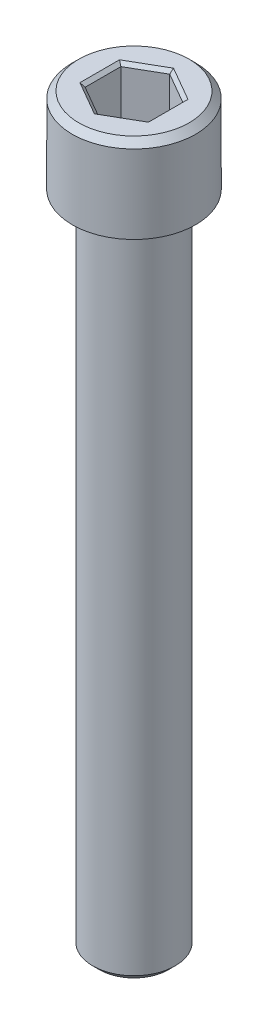
ISO-10303-21;
HEADER;
FILE_DESCRIPTION(('STEP AP214'),'2;1');
FILE_NAME('part.step','',(''),(''),'','','');
FILE_SCHEMA(('AUTOMOTIVE_DESIGN { 1 0 10303 214 1 1 1 1 }'));
ENDSEC;
DATA;
#1=APPLICATION_CONTEXT('core data for automotive mechanical design processes');
#2=APPLICATION_PROTOCOL_DEFINITION('international standard','automotive_design',2000,#1);
#3=PRODUCT_CONTEXT('',#1,'mechanical');
#4=PRODUCT('Part','Part','',(#3));
#5=PRODUCT_RELATED_PRODUCT_CATEGORY('part','',(#4));
#6=PRODUCT_DEFINITION_FORMATION('','',#4);
#7=PRODUCT_DEFINITION_CONTEXT('part definition',#1,'design');
#8=PRODUCT_DEFINITION('design','',#6,#7);
#9=PRODUCT_DEFINITION_SHAPE('','',#8);
#10=(LENGTH_UNIT() NAMED_UNIT(*) SI_UNIT(.MILLI.,.METRE.));
#11=(NAMED_UNIT(*) PLANE_ANGLE_UNIT() SI_UNIT($,.RADIAN.));
#12=(NAMED_UNIT(*) SI_UNIT($,.STERADIAN.) SOLID_ANGLE_UNIT());
#13=UNCERTAINTY_MEASURE_WITH_UNIT(LENGTH_MEASURE(1.E-05),#10,'distance_accuracy_value','');
#14=(GEOMETRIC_REPRESENTATION_CONTEXT(3) GLOBAL_UNCERTAINTY_ASSIGNED_CONTEXT((#13)) GLOBAL_UNIT_ASSIGNED_CONTEXT((#10,
#11,#12)) REPRESENTATION_CONTEXT('',''));
#15=CARTESIAN_POINT('',(0.,0.,0.));
#16=DIRECTION('',(0.,0.,1.));
#17=DIRECTION('',(1.,0.,0.));
#18=AXIS2_PLACEMENT_3D('',#15,#16,#17);
#19=CARTESIAN_POINT('',(-4.77519999999997,-4.57200000000002,0.));
#20=DIRECTION('',(0.,-1.,0.));
#21=DIRECTION('',(0.,0.,-1.));
#22=AXIS2_PLACEMENT_3D('',#19,#20,#21);
#23=PLANE('',#22);
#24=DIRECTION('',(-0.866025403784438,0.,0.5));
#25=VECTOR('',#24,1.);
#26=CARTESIAN_POINT('',(2.3876,-4.57200000000002,1.37848150271715));
#27=LINE('',#26,#25);
#28=CARTESIAN_POINT('',(2.3876,-4.57200000000002,1.37848150271715));
#29=VERTEX_POINT('',#28);
#30=CARTESIAN_POINT('',(0.,-4.57200000000002,2.7569630054343));
#31=VERTEX_POINT('',#30);
#32=EDGE_CURVE('E86',#29,#31,#27,.T.);
#33=ORIENTED_EDGE('',*,*,#32,.F.);
#34=DIRECTION('',(0.,0.,1.));
#35=VECTOR('',#34,1.);
#36=CARTESIAN_POINT('',(2.3876,-4.57200000000002,-1.37848150271715));
#37=LINE('',#36,#35);
#38=CARTESIAN_POINT('',(2.3876,-4.57200000000002,-1.37848150271715));
#39=VERTEX_POINT('',#38);
#40=EDGE_CURVE('E91',#39,#29,#37,.T.);
#41=ORIENTED_EDGE('',*,*,#40,.F.);
#42=DIRECTION('',(0.866025403784438,0.,0.5));
#43=VECTOR('',#42,1.);
#44=CARTESIAN_POINT('',(0.,-4.57200000000002,-2.75696300543429));
#45=LINE('',#44,#43);
#46=CARTESIAN_POINT('',(0.,-4.57200000000002,-2.75696300543429));
#47=VERTEX_POINT('',#46);
#48=EDGE_CURVE('E172',#47,#39,#45,.T.);
#49=ORIENTED_EDGE('',*,*,#48,.F.);
#50=DIRECTION('',(0.866025403784438,0.,-0.5));
#51=VECTOR('',#50,1.);
#52=CARTESIAN_POINT('',(-2.38759999999999,-4.57200000000002,-1.37848150271714));
#53=LINE('',#52,#51);
#54=CARTESIAN_POINT('',(-2.38759999999997,-4.57200000000002,-1.37848150271714));
#55=VERTEX_POINT('',#54);
#56=EDGE_CURVE('E178',#55,#47,#53,.T.);
#57=ORIENTED_EDGE('',*,*,#56,.F.);
#58=DIRECTION('',(0.,0.,-1.));
#59=VECTOR('',#58,1.);
#60=CARTESIAN_POINT('',(-2.38759999999996,-4.57200000000002,1.37848150271717));
#61=LINE('',#60,#59);
#62=CARTESIAN_POINT('',(-2.38759999999996,-4.57200000000002,1.37848150271717));
#63=VERTEX_POINT('',#62);
#64=EDGE_CURVE('E183',#63,#55,#61,.T.);
#65=ORIENTED_EDGE('',*,*,#64,.F.);
#66=DIRECTION('',(-0.866025403784438,0.,-0.500000000000001));
#67=VECTOR('',#66,1.);
#68=CARTESIAN_POINT('',(0.,-4.57200000000002,2.75696300543431));
#69=LINE('',#68,#67);
#70=EDGE_CURVE('E102',#31,#63,#69,.T.);
#71=ORIENTED_EDGE('',*,*,#70,.F.);
#72=EDGE_LOOP('',(#33,#41,#49,#57,#65,#71));
#73=FACE_BOUND('',#72,.T.);
#74=ADVANCED_FACE('F17',(#73),#23,.F.);
#75=CARTESIAN_POINT('',(2.3876,-4.57200000000002,-1.37848150271715));
#76=DIRECTION('',(-1.,0.,0.));
#77=DIRECTION('',(0.,0.,1.));
#78=AXIS2_PLACEMENT_3D('',#75,#76,#77);
#79=PLANE('',#78);
#80=DIRECTION('',(0.,1.,0.));
#81=VECTOR('',#80,1.);
#82=CARTESIAN_POINT('',(2.3876,-4.57200000000002,-1.37848150271715));
#83=LINE('',#82,#81);
#84=CARTESIAN_POINT('',(2.38760000000001,-0.253999999999981,-1.37848150271715));
#85=VERTEX_POINT('',#84);
#86=EDGE_CURVE('E96',#39,#85,#83,.T.);
#87=ORIENTED_EDGE('',*,*,#86,.F.);
#88=ORIENTED_EDGE('',*,*,#40,.T.);
#89=DIRECTION('',(0.,1.,0.));
#90=VECTOR('',#89,1.);
#91=CARTESIAN_POINT('',(2.3876,-4.57200000000002,1.37848150271715));
#92=LINE('',#91,#90);
#93=CARTESIAN_POINT('',(2.38760000000001,-0.25399999999998,1.37848150271715));
#94=VERTEX_POINT('',#93);
#95=EDGE_CURVE('E93',#94,#29,#92,.F.);
#96=ORIENTED_EDGE('',*,*,#95,.F.);
#97=DIRECTION('',(0.,0.,1.));
#98=VECTOR('',#97,1.);
#99=CARTESIAN_POINT('',(2.38760000000002,-0.25399999999999,0.));
#100=LINE('',#99,#98);
#101=EDGE_CURVE('E170',#94,#85,#100,.F.);
#102=ORIENTED_EDGE('',*,*,#101,.T.);
#103=EDGE_LOOP('',(#87,#88,#96,#102));
#104=FACE_BOUND('',#103,.T.);
#105=ADVANCED_FACE('F92',(#104),#79,.T.);
#106=CARTESIAN_POINT('',(2.3876,-4.57200000000002,1.37848150271715));
#107=DIRECTION('',(-0.5,0.,-0.866025403784438));
#108=DIRECTION('',(-0.866025403784438,0.,0.5));
#109=AXIS2_PLACEMENT_3D('',#106,#107,#108);
#110=PLANE('',#109);
#111=ORIENTED_EDGE('',*,*,#95,.T.);
#112=ORIENTED_EDGE('',*,*,#32,.T.);
#113=DIRECTION('',(0.,1.,0.));
#114=VECTOR('',#113,1.);
#115=CARTESIAN_POINT('',(0.,-4.57200000000002,2.75696300543431));
#116=LINE('',#115,#114);
#117=CARTESIAN_POINT('',(0.,-0.253999999999979,2.75696300543431));
#118=VERTEX_POINT('',#117);
#119=EDGE_CURVE('E104',#118,#31,#116,.F.);
#120=ORIENTED_EDGE('',*,*,#119,.F.);
#121=DIRECTION('',(0.866025403784438,0.,-0.500000000000001));
#122=VECTOR('',#121,1.);
#123=CARTESIAN_POINT('',(0.,-0.253999999999987,2.75696300543432));
#124=LINE('',#123,#122);
#125=EDGE_CURVE('E108',#118,#94,#124,.T.);
#126=ORIENTED_EDGE('',*,*,#125,.T.);
#127=EDGE_LOOP('',(#111,#112,#120,#126));
#128=FACE_BOUND('',#127,.T.);
#129=ADVANCED_FACE('F106',(#128),#110,.T.);
#130=CARTESIAN_POINT('',(0.,-4.57200000000002,2.75696300543431));
#131=DIRECTION('',(0.500000000000001,0.,-0.866025403784438));
#132=DIRECTION('',(-0.866025403784438,0.,-0.500000000000001));
#133=AXIS2_PLACEMENT_3D('',#130,#131,#132);
#134=PLANE('',#133);
#135=ORIENTED_EDGE('',*,*,#119,.T.);
#136=ORIENTED_EDGE('',*,*,#70,.T.);
#137=DIRECTION('',(0.,1.,0.));
#138=VECTOR('',#137,1.);
#139=CARTESIAN_POINT('',(-2.38759999999996,-4.57200000000002,1.37848150271717));
#140=LINE('',#139,#138);
#141=CARTESIAN_POINT('',(-2.38759999999997,-0.253999999999979,1.37848150271717));
#142=VERTEX_POINT('',#141);
#143=EDGE_CURVE('E185',#142,#63,#140,.F.);
#144=ORIENTED_EDGE('',*,*,#143,.F.);
#145=DIRECTION('',(0.866025403784438,0.,0.500000000000002));
#146=VECTOR('',#145,1.);
#147=CARTESIAN_POINT('',(-2.38759999999997,-0.253999999999992,1.37848150271718));
#148=LINE('',#147,#146);
#149=EDGE_CURVE('E164',#142,#118,#148,.T.);
#150=ORIENTED_EDGE('',*,*,#149,.T.);
#151=EDGE_LOOP('',(#135,#136,#144,#150));
#152=FACE_BOUND('',#151,.T.);
#153=ADVANCED_FACE('F189',(#152),#134,.T.);
#154=CARTESIAN_POINT('',(-2.38759999999996,-4.57200000000002,1.37848150271717));
#155=DIRECTION('',(1.,0.,0.));
#156=DIRECTION('',(0.,0.,-1.));
#157=AXIS2_PLACEMENT_3D('',#154,#155,#156);
#158=PLANE('',#157);
#159=ORIENTED_EDGE('',*,*,#143,.T.);
#160=ORIENTED_EDGE('',*,*,#64,.T.);
#161=DIRECTION('',(0.,1.,0.));
#162=VECTOR('',#161,1.);
#163=CARTESIAN_POINT('',(-2.38759999999999,-4.57200000000002,-1.37848150271714));
#164=LINE('',#163,#162);
#165=CARTESIAN_POINT('',(-2.38759999999998,-0.253999999999979,-1.37848150271714));
#166=VERTEX_POINT('',#165);
#167=EDGE_CURVE('E180',#166,#55,#164,.F.);
#168=ORIENTED_EDGE('',*,*,#167,.F.);
#169=DIRECTION('',(0.,0.,1.));
#170=VECTOR('',#169,1.);
#171=CARTESIAN_POINT('',(-2.3876,-0.253999999999983,0.));
#172=LINE('',#171,#170);
#173=EDGE_CURVE('E159',#166,#142,#172,.T.);
#174=ORIENTED_EDGE('',*,*,#173,.T.);
#175=EDGE_LOOP('',(#159,#160,#168,#174));
#176=FACE_BOUND('',#175,.T.);
#177=ADVANCED_FACE('F219',(#176),#158,.T.);
#178=CARTESIAN_POINT('',(-2.38759999999999,-4.57200000000002,-1.37848150271714));
#179=DIRECTION('',(0.5,0.,0.866025403784438));
#180=DIRECTION('',(0.866025403784438,0.,-0.5));
#181=AXIS2_PLACEMENT_3D('',#178,#179,#180);
#182=PLANE('',#181);
#183=ORIENTED_EDGE('',*,*,#167,.T.);
#184=ORIENTED_EDGE('',*,*,#56,.T.);
#185=DIRECTION('',(0.,1.,0.));
#186=VECTOR('',#185,1.);
#187=CARTESIAN_POINT('',(0.,-4.57200000000002,-2.75696300543429));
#188=LINE('',#187,#186);
#189=CARTESIAN_POINT('',(0.,-0.253999999999979,-2.7569630054343));
#190=VERTEX_POINT('',#189);
#191=EDGE_CURVE('E174',#190,#47,#188,.F.);
#192=ORIENTED_EDGE('',*,*,#191,.F.);
#193=DIRECTION('',(-0.866025403784438,0.,0.5));
#194=VECTOR('',#193,1.);
#195=CARTESIAN_POINT('',(0.,-0.253999999999991,-2.75696300543431));
#196=LINE('',#195,#194);
#197=EDGE_CURVE('E154',#190,#166,#196,.T.);
#198=ORIENTED_EDGE('',*,*,#197,.T.);
#199=EDGE_LOOP('',(#183,#184,#192,#198));
#200=FACE_BOUND('',#199,.T.);
#201=ADVANCED_FACE('F215',(#200),#182,.T.);
#202=CARTESIAN_POINT('',(0.,-4.57200000000002,-2.75696300543429));
#203=DIRECTION('',(-0.5,0.,0.866025403784438));
#204=DIRECTION('',(0.866025403784438,0.,0.5));
#205=AXIS2_PLACEMENT_3D('',#202,#203,#204);
#206=PLANE('',#205);
#207=ORIENTED_EDGE('',*,*,#191,.T.);
#208=ORIENTED_EDGE('',*,*,#48,.T.);
#209=ORIENTED_EDGE('',*,*,#86,.T.);
#210=DIRECTION('',(-0.866025403784438,0.,-0.5));
#211=VECTOR('',#210,1.);
#212=CARTESIAN_POINT('',(2.38760000000001,-0.253999999999982,-1.37848150271715));
#213=LINE('',#212,#211);
#214=EDGE_CURVE('E146',#85,#190,#213,.T.);
#215=ORIENTED_EDGE('',*,*,#214,.T.);
#216=EDGE_LOOP('',(#207,#208,#209,#215));
#217=FACE_BOUND('',#216,.T.);
#218=ADVANCED_FACE('F210',(#217),#206,.T.);
#219=CARTESIAN_POINT('',(2.64160000000001,0.,0.));
#220=DIRECTION('',(0.707106781186548,-0.707106781186547,0.));
#221=DIRECTION('',(0.707106781186547,0.707106781186548,0.));
#222=AXIS2_PLACEMENT_3D('',#219,#220,#221);
#223=PLANE('',#222);
#224=ORIENTED_EDGE('',*,*,#101,.F.);
#225=DIRECTION('',(0.654653670707951,0.654653670707987,0.377964473009256));
#226=VECTOR('',#225,1.);
#227=CARTESIAN_POINT('',(2.38760000000001,-0.253999999999991,1.37848150271716));
#228=LINE('',#227,#226);
#229=CARTESIAN_POINT('',(2.64160000000001,0.,1.52512847109134));
#230=VERTEX_POINT('',#229);
#231=EDGE_CURVE('E167',#94,#230,#228,.T.);
#232=ORIENTED_EDGE('',*,*,#231,.T.);
#233=DIRECTION('',(0.,0.,1.));
#234=VECTOR('',#233,1.);
#235=CARTESIAN_POINT('',(2.64160000000001,0.,0.));
#236=LINE('',#235,#234);
#237=CARTESIAN_POINT('',(2.64160000000001,0.,-1.52512847109129));
#238=VERTEX_POINT('',#237);
#239=EDGE_CURVE('E142',#238,#230,#236,.T.);
#240=ORIENTED_EDGE('',*,*,#239,.F.);
#241=DIRECTION('',(-0.654653670708017,-0.654653670707961,0.377964473009186));
#242=VECTOR('',#241,1.);
#243=CARTESIAN_POINT('',(2.64160000000001,0.,-1.52512847109129));
#244=LINE('',#243,#242);
#245=EDGE_CURVE('E149',#238,#85,#244,.T.);
#246=ORIENTED_EDGE('',*,*,#245,.T.);
#247=EDGE_LOOP('',(#224,#232,#240,#246));
#248=FACE_BOUND('',#247,.T.);
#249=ADVANCED_FACE('F205',(#248),#223,.F.);
#250=CARTESIAN_POINT('',(1.3208,0.,2.28769270663698));
#251=DIRECTION('',(0.353553390593274,-0.707106781186548,0.612372435695794));
#252=DIRECTION('',(0.,-0.654653670707976,-0.755928946018455));
#253=AXIS2_PLACEMENT_3D('',#250,#251,#252);
#254=PLANE('',#253);
#255=ORIENTED_EDGE('',*,*,#125,.F.);
#256=DIRECTION('',(0.,-0.654653670707977,-0.755928946018455));
#257=VECTOR('',#256,1.);
#258=CARTESIAN_POINT('',(0.,-0.377371428571426,2.61450595044226));
#259=LINE('',#258,#257);
#260=CARTESIAN_POINT('',(0.,0.,3.05025694218264));
#261=VERTEX_POINT('',#260);
#262=EDGE_CURVE('E162',#118,#261,#259,.F.);
#263=ORIENTED_EDGE('',*,*,#262,.T.);
#264=DIRECTION('',(-0.866025403784443,0.,0.499999999999993));
#265=VECTOR('',#264,1.);
#266=CARTESIAN_POINT('',(2.64160000000001,0.,1.52512847109135));
#267=LINE('',#266,#265);
#268=EDGE_CURVE('E139',#230,#261,#267,.T.);
#269=ORIENTED_EDGE('',*,*,#268,.F.);
#270=ORIENTED_EDGE('',*,*,#231,.F.);
#271=EDGE_LOOP('',(#255,#263,#269,#270));
#272=FACE_BOUND('',#271,.T.);
#273=ADVANCED_FACE('F196',(#272),#254,.F.);
#274=CARTESIAN_POINT('',(-1.3208,0.,2.28769270663698));
#275=DIRECTION('',(-0.353553390593274,-0.707106781186548,0.612372435695794));
#276=DIRECTION('',(0.,-0.654653670707977,-0.755928946018455));
#277=AXIS2_PLACEMENT_3D('',#274,#275,#276);
#278=PLANE('',#277);
#279=DIRECTION('',(-0.866025403784436,0.,-0.500000000000004));
#280=VECTOR('',#279,1.);
#281=CARTESIAN_POINT('',(0.,0.,3.05025694218264));
#282=LINE('',#281,#280);
#283=CARTESIAN_POINT('',(-2.64159999999998,0.,1.52512847109132));
#284=VERTEX_POINT('',#283);
#285=EDGE_CURVE('E136',#261,#284,#282,.T.);
#286=ORIENTED_EDGE('',*,*,#285,.F.);
#287=ORIENTED_EDGE('',*,*,#262,.F.);
#288=ORIENTED_EDGE('',*,*,#149,.F.);
#289=DIRECTION('',(-0.654653670707984,0.654653670707984,0.377964473009202));
#290=VECTOR('',#289,1.);
#291=CARTESIAN_POINT('',(-2.38759999999998,-0.253999999999997,1.37848150271717));
#292=LINE('',#291,#290);
#293=EDGE_CURVE('E157',#142,#284,#292,.T.);
#294=ORIENTED_EDGE('',*,*,#293,.T.);
#295=EDGE_LOOP('',(#286,#287,#288,#294));
#296=FACE_BOUND('',#295,.T.);
#297=ADVANCED_FACE('F199',(#296),#278,.F.);
#298=CARTESIAN_POINT('',(-2.64159999999998,0.,0.));
#299=DIRECTION('',(-0.707106781186548,-0.707106781186547,0.));
#300=DIRECTION('',(0.707106781186547,-0.707106781186548,0.));
#301=AXIS2_PLACEMENT_3D('',#298,#299,#300);
#302=PLANE('',#301);
#303=DIRECTION('',(0.,0.,1.));
#304=VECTOR('',#303,1.);
#305=CARTESIAN_POINT('',(-2.64159999999998,0.,0.));
#306=LINE('',#305,#304);
#307=CARTESIAN_POINT('',(-2.64159999999998,0.,-1.52512847109131));
#308=VERTEX_POINT('',#307);
#309=EDGE_CURVE('E133',#284,#308,#306,.F.);
#310=ORIENTED_EDGE('',*,*,#309,.F.);
#311=ORIENTED_EDGE('',*,*,#293,.F.);
#312=ORIENTED_EDGE('',*,*,#173,.F.);
#313=DIRECTION('',(-0.654653670707983,0.654653670707975,-0.377964473009221));
#314=VECTOR('',#313,1.);
#315=CARTESIAN_POINT('',(-2.3876,-0.253999999999991,-1.37848150271715));
#316=LINE('',#315,#314);
#317=EDGE_CURVE('E152',#166,#308,#316,.T.);
#318=ORIENTED_EDGE('',*,*,#317,.T.);
#319=EDGE_LOOP('',(#310,#311,#312,#318));
#320=FACE_BOUND('',#319,.T.);
#321=ADVANCED_FACE('F217',(#320),#302,.F.);
#322=CARTESIAN_POINT('',(-1.3208,0.,-2.28769270663697));
#323=DIRECTION('',(-0.353553390593274,-0.707106781186547,-0.612372435695795));
#324=DIRECTION('',(0.,0.654653670707977,-0.755928946018454));
#325=AXIS2_PLACEMENT_3D('',#322,#323,#324);
#326=PLANE('',#325);
#327=ORIENTED_EDGE('',*,*,#197,.F.);
#328=DIRECTION('',(0.,0.654653670707977,-0.755928946018455));
#329=VECTOR('',#328,1.);
#330=CARTESIAN_POINT('',(0.,-0.377371428571423,-2.61450595044224));
#331=LINE('',#330,#329);
#332=CARTESIAN_POINT('',(0.,0.,-3.05025694218262));
#333=VERTEX_POINT('',#332);
#334=EDGE_CURVE('E35',#190,#333,#331,.T.);
#335=ORIENTED_EDGE('',*,*,#334,.T.);
#336=DIRECTION('',(0.86602540378444,0.,-0.499999999999998));
#337=VECTOR('',#336,1.);
#338=CARTESIAN_POINT('',(-2.64159999999999,0.,-1.52512847109131));
#339=LINE('',#338,#337);
#340=EDGE_CURVE('E130',#308,#333,#339,.T.);
#341=ORIENTED_EDGE('',*,*,#340,.F.);
#342=ORIENTED_EDGE('',*,*,#317,.F.);
#343=EDGE_LOOP('',(#327,#335,#341,#342));
#344=FACE_BOUND('',#343,.T.);
#345=ADVANCED_FACE('F212',(#344),#326,.F.);
#346=CARTESIAN_POINT('',(1.3208,0.,-2.28769270663696));
#347=DIRECTION('',(0.353553390593274,-0.707106781186548,-0.612372435695794));
#348=DIRECTION('',(0.,0.654653670707977,-0.755928946018455));
#349=AXIS2_PLACEMENT_3D('',#346,#347,#348);
#350=PLANE('',#349);
#351=ORIENTED_EDGE('',*,*,#214,.F.);
#352=ORIENTED_EDGE('',*,*,#245,.F.);
#353=DIRECTION('',(0.866025403784436,0.,0.500000000000005));
#354=VECTOR('',#353,1.);
#355=CARTESIAN_POINT('',(0.,0.,-3.05025694218262));
#356=LINE('',#355,#354);
#357=EDGE_CURVE('E125',#333,#238,#356,.T.);
#358=ORIENTED_EDGE('',*,*,#357,.F.);
#359=ORIENTED_EDGE('',*,*,#334,.F.);
#360=EDGE_LOOP('',(#351,#352,#358,#359));
#361=FACE_BOUND('',#360,.T.);
#362=ADVANCED_FACE('F208',(#361),#350,.F.);
#363=CARTESIAN_POINT('',(0.,0.,0.));
#364=DIRECTION('',(0.,1.,0.));
#365=DIRECTION('',(0.,0.,1.));
#366=AXIS2_PLACEMENT_3D('',#363,#364,#365);
#367=PLANE('',#366);
#368=CARTESIAN_POINT('',(0.,0.,0.));
#369=DIRECTION('',(0.,-1.,0.));
#370=DIRECTION('',(0.,0.,-1.));
#371=AXIS2_PLACEMENT_3D('',#368,#369,#370);
#372=CIRCLE('',#371,4.25450000005867);
#373=CARTESIAN_POINT('',(0.,0.,-4.25450000005867));
#374=VERTEX_POINT('',#373);
#375=EDGE_CURVE('E20',#374,#374,#372,.T.);
#376=ORIENTED_EDGE('',*,*,#375,.F.);
#377=EDGE_LOOP('',(#376));
#378=FACE_BOUND('',#377,.T.);
#379=ORIENTED_EDGE('',*,*,#340,.T.);
#380=ORIENTED_EDGE('',*,*,#357,.T.);
#381=ORIENTED_EDGE('',*,*,#239,.T.);
#382=ORIENTED_EDGE('',*,*,#268,.T.);
#383=ORIENTED_EDGE('',*,*,#285,.T.);
#384=ORIENTED_EDGE('',*,*,#309,.T.);
#385=EDGE_LOOP('',(#379,#380,#381,#382,#383,#384));
#386=FACE_BOUND('',#385,.T.);
#387=ADVANCED_FACE('F202',(#378,#386),#367,.T.);
#388=CARTESIAN_POINT('',(0.,-0.507999999911135,0.));
#389=DIRECTION('',(0.,-1.,0.));
#390=DIRECTION('',(0.,0.,-1.));
#391=AXIS2_PLACEMENT_3D('',#388,#389,#390);
#392=CONICAL_SURFACE('',#391,4.76250000002665,0.785398163453397);
#393=CARTESIAN_POINT('',(0.,-0.507999999999953,0.));
#394=DIRECTION('',(0.,1.,0.));
#395=DIRECTION('',(0.,0.,1.));
#396=AXIS2_PLACEMENT_3D('',#393,#394,#395);
#397=CIRCLE('',#396,4.7625);
#398=CARTESIAN_POINT('',(0.,-0.507999999999953,4.7625));
#399=VERTEX_POINT('',#398);
#400=EDGE_CURVE('E117',#399,#399,#397,.F.);
#401=ORIENTED_EDGE('',*,*,#400,.F.);
#402=EDGE_LOOP('',(#401));
#403=FACE_BOUND('',#402,.T.);
#404=ORIENTED_EDGE('',*,*,#375,.T.);
#405=EDGE_LOOP('',(#404));
#406=FACE_BOUND('',#405,.T.);
#407=ADVANCED_FACE('F252',(#403,#406),#392,.T.);
#408=CARTESIAN_POINT('',(0.,-57.3531999999999,0.));
#409=DIRECTION('',(0.,1.,0.));
#410=DIRECTION('',(0.,0.,1.));
#411=AXIS2_PLACEMENT_3D('',#408,#409,#410);
#412=PLANE('',#411);
#413=CARTESIAN_POINT('',(0.,-57.3532000000228,0.));
#414=DIRECTION('',(0.,1.,0.));
#415=DIRECTION('',(-1.,0.,0.));
#416=AXIS2_PLACEMENT_3D('',#413,#414,#415);
#417=CIRCLE('',#416,2.66699999991715);
#418=CARTESIAN_POINT('',(-2.66699999991715,-57.3532000000228,0.));
#419=VERTEX_POINT('',#418);
#420=EDGE_CURVE('E115',#419,#419,#417,.T.);
#421=ORIENTED_EDGE('',*,*,#420,.F.);
#422=EDGE_LOOP('',(#421));
#423=FACE_BOUND('',#422,.T.);
#424=ADVANCED_FACE('F249',(#423),#412,.F.);
#425=CARTESIAN_POINT('',(0.,-6.55319999999992,0.));
#426=DIRECTION('',(0.,1.,0.));
#427=DIRECTION('',(0.,0.,1.));
#428=AXIS2_PLACEMENT_3D('',#425,#426,#427);
#429=CYLINDRICAL_SURFACE('',#428,4.7625);
#430=ORIENTED_EDGE('',*,*,#400,.T.);
#431=EDGE_LOOP('',(#430));
#432=FACE_BOUND('',#431,.T.);
#433=CARTESIAN_POINT('',(0.,-6.55319999999992,0.));
#434=DIRECTION('',(0.,1.,0.));
#435=DIRECTION('',(0.,0.,1.));
#436=AXIS2_PLACEMENT_3D('',#433,#434,#435);
#437=CIRCLE('',#436,4.7625);
#438=CARTESIAN_POINT('',(0.,-6.55319999999992,4.7625));
#439=VERTEX_POINT('',#438);
#440=EDGE_CURVE('E113',#439,#439,#437,.T.);
#441=ORIENTED_EDGE('',*,*,#440,.T.);
#442=EDGE_LOOP('',(#441));
#443=FACE_BOUND('',#442,.T.);
#444=ADVANCED_FACE('F245',(#432,#443),#429,.T.);
#445=CARTESIAN_POINT('',(0.,-56.8451999999411,0.));
#446=DIRECTION('',(0.,1.,0.));
#447=DIRECTION('',(-1.,0.,0.));
#448=AXIS2_PLACEMENT_3D('',#445,#446,#447);
#449=CONICAL_SURFACE('',#448,3.17499999999882,0.785398163397448);
#450=CARTESIAN_POINT('',(0.,-56.8451999999999,0.));
#451=DIRECTION('',(0.,1.,0.));
#452=DIRECTION('',(0.,0.,1.));
#453=AXIS2_PLACEMENT_3D('',#450,#451,#452);
#454=CIRCLE('',#453,3.175);
#455=CARTESIAN_POINT('',(0.,-56.8451999999999,3.175));
#456=VERTEX_POINT('',#455);
#457=EDGE_CURVE('E26',#456,#456,#454,.T.);
#458=ORIENTED_EDGE('',*,*,#457,.F.);
#459=EDGE_LOOP('',(#458));
#460=FACE_BOUND('',#459,.T.);
#461=ORIENTED_EDGE('',*,*,#420,.T.);
#462=EDGE_LOOP('',(#461));
#463=FACE_BOUND('',#462,.T.);
#464=ADVANCED_FACE('F238',(#460,#463),#449,.T.);
#465=CARTESIAN_POINT('',(0.,-6.55319999999992,0.));
#466=DIRECTION('',(0.,1.,0.));
#467=DIRECTION('',(0.,0.,1.));
#468=AXIS2_PLACEMENT_3D('',#465,#466,#467);
#469=PLANE('',#468);
#470=ORIENTED_EDGE('',*,*,#440,.F.);
#471=EDGE_LOOP('',(#470));
#472=FACE_BOUND('',#471,.T.);
#473=CARTESIAN_POINT('',(0.,-6.55319999999993,0.));
#474=DIRECTION('',(0.,1.,0.));
#475=DIRECTION('',(0.,0.,1.));
#476=AXIS2_PLACEMENT_3D('',#473,#474,#475);
#477=CIRCLE('',#476,3.175);
#478=CARTESIAN_POINT('',(0.,-6.55319999999993,3.175));
#479=VERTEX_POINT('',#478);
#480=EDGE_CURVE('E11',#479,#479,#477,.F.);
#481=ORIENTED_EDGE('',*,*,#480,.F.);
#482=EDGE_LOOP('',(#481));
#483=FACE_BOUND('',#482,.T.);
#484=ADVANCED_FACE('F232',(#472,#483),#469,.F.);
#485=CARTESIAN_POINT('',(0.,-57.3531999999999,0.));
#486=DIRECTION('',(0.,1.,0.));
#487=DIRECTION('',(0.,0.,1.));
#488=AXIS2_PLACEMENT_3D('',#485,#486,#487);
#489=CYLINDRICAL_SURFACE('',#488,3.175);
#490=ORIENTED_EDGE('',*,*,#480,.T.);
#491=EDGE_LOOP('',(#490));
#492=FACE_BOUND('',#491,.T.);
#493=ORIENTED_EDGE('',*,*,#457,.T.);
#494=EDGE_LOOP('',(#493));
#495=FACE_BOUND('',#494,.T.);
#496=ADVANCED_FACE('F230',(#492,#495),#489,.T.);
#497=CLOSED_SHELL('',(#74,#105,#129,#153,#177,#201,#218,#249,#273,#297,#321,#345,#362,#387,#407,
#424,#444,#464,#484,#496));
#498=MANIFOLD_SOLID_BREP('B1',#497);
#499=ADVANCED_BREP_SHAPE_REPRESENTATION('',(#18,#498),#14);
#500=SHAPE_DEFINITION_REPRESENTATION(#9,#499);
ENDSEC;
END-ISO-10303-21;
